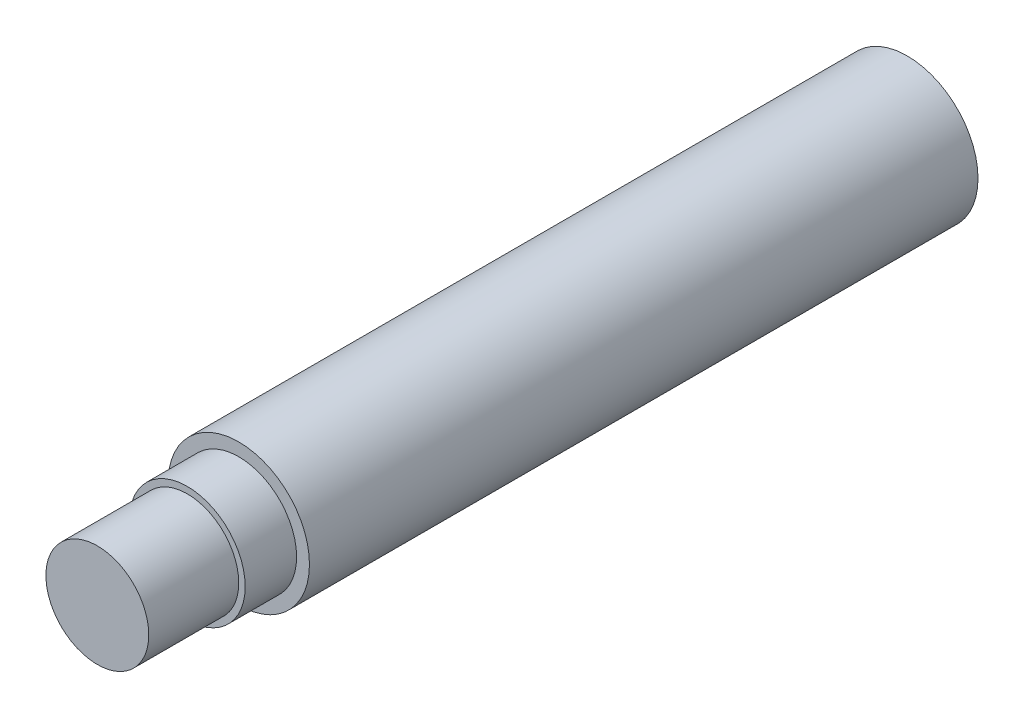
ISO-10303-21;
HEADER;
FILE_DESCRIPTION(('STEP AP214'),'2;1');
FILE_NAME('part.step','',(''),(''),'','','');
FILE_SCHEMA(('AUTOMOTIVE_DESIGN { 1 0 10303 214 1 1 1 1 }'));
ENDSEC;
DATA;
#1=APPLICATION_CONTEXT('core data for automotive mechanical design processes');
#2=APPLICATION_PROTOCOL_DEFINITION('international standard','automotive_design',2000,#1);
#3=PRODUCT_CONTEXT('',#1,'mechanical');
#4=PRODUCT('Part','Part','',(#3));
#5=PRODUCT_RELATED_PRODUCT_CATEGORY('part','',(#4));
#6=PRODUCT_DEFINITION_FORMATION('','',#4);
#7=PRODUCT_DEFINITION_CONTEXT('part definition',#1,'design');
#8=PRODUCT_DEFINITION('design','',#6,#7);
#9=PRODUCT_DEFINITION_SHAPE('','',#8);
#10=(LENGTH_UNIT() NAMED_UNIT(*) SI_UNIT(.MILLI.,.METRE.));
#11=(NAMED_UNIT(*) PLANE_ANGLE_UNIT() SI_UNIT($,.RADIAN.));
#12=(NAMED_UNIT(*) SI_UNIT($,.STERADIAN.) SOLID_ANGLE_UNIT());
#13=UNCERTAINTY_MEASURE_WITH_UNIT(LENGTH_MEASURE(1.E-05),#10,'distance_accuracy_value','');
#14=(GEOMETRIC_REPRESENTATION_CONTEXT(3) GLOBAL_UNCERTAINTY_ASSIGNED_CONTEXT((#13)) GLOBAL_UNIT_ASSIGNED_CONTEXT((#10,
#11,#12)) REPRESENTATION_CONTEXT('',''));
#15=CARTESIAN_POINT('',(0.,0.,0.));
#16=DIRECTION('',(0.,0.,1.));
#17=DIRECTION('',(1.,0.,0.));
#18=AXIS2_PLACEMENT_3D('',#15,#16,#17);
#19=CARTESIAN_POINT('',(0.,0.,56.));
#20=DIRECTION('',(0.,0.,1.));
#21=DIRECTION('',(1.,0.,0.));
#22=AXIS2_PLACEMENT_3D('',#19,#20,#21);
#23=PLANE('',#22);
#24=CARTESIAN_POINT('',(0.,0.,56.));
#25=DIRECTION('',(0.,0.,1.));
#26=DIRECTION('',(1.,0.,0.));
#27=AXIS2_PLACEMENT_3D('',#24,#25,#26);
#28=CIRCLE('',#27,4.5);
#29=CARTESIAN_POINT('',(4.5,0.,56.));
#30=VERTEX_POINT('',#29);
#31=EDGE_CURVE('E72',#30,#30,#28,.T.);
#32=ORIENTED_EDGE('',*,*,#31,.T.);
#33=EDGE_LOOP('',(#32));
#34=FACE_BOUND('',#33,.T.);
#35=CARTESIAN_POINT('',(0.,0.,56.));
#36=DIRECTION('',(0.,0.,1.));
#37=DIRECTION('',(1.,0.,0.));
#38=AXIS2_PLACEMENT_3D('',#35,#36,#37);
#39=CIRCLE('',#38,4.);
#40=CARTESIAN_POINT('',(4.,0.,56.));
#41=VERTEX_POINT('',#40);
#42=EDGE_CURVE('E59',#41,#41,#39,.T.);
#43=ORIENTED_EDGE('',*,*,#42,.F.);
#44=EDGE_LOOP('',(#43));
#45=FACE_BOUND('',#44,.T.);
#46=ADVANCED_FACE('F37',(#34,#45),#23,.T.);
#47=CARTESIAN_POINT('',(0.,0.,52.));
#48=DIRECTION('',(0.,0.,1.));
#49=DIRECTION('',(1.,0.,0.));
#50=AXIS2_PLACEMENT_3D('',#47,#48,#49);
#51=PLANE('',#50);
#52=CARTESIAN_POINT('',(0.,0.,52.));
#53=DIRECTION('',(0.,0.,1.));
#54=DIRECTION('',(1.,0.,0.));
#55=AXIS2_PLACEMENT_3D('',#52,#53,#54);
#56=CIRCLE('',#55,5.5);
#57=CARTESIAN_POINT('',(5.5,0.,52.));
#58=VERTEX_POINT('',#57);
#59=EDGE_CURVE('E11',#58,#58,#56,.T.);
#60=ORIENTED_EDGE('',*,*,#59,.T.);
#61=EDGE_LOOP('',(#60));
#62=FACE_BOUND('',#61,.T.);
#63=CARTESIAN_POINT('',(0.,0.,52.));
#64=DIRECTION('',(0.,0.,1.));
#65=DIRECTION('',(1.,0.,0.));
#66=AXIS2_PLACEMENT_3D('',#63,#64,#65);
#67=CIRCLE('',#66,4.5);
#68=CARTESIAN_POINT('',(4.5,0.,52.));
#69=VERTEX_POINT('',#68);
#70=EDGE_CURVE('E70',#69,#69,#67,.T.);
#71=ORIENTED_EDGE('',*,*,#70,.F.);
#72=EDGE_LOOP('',(#71));
#73=FACE_BOUND('',#72,.T.);
#74=ADVANCED_FACE('F91',(#62,#73),#51,.T.);
#75=CARTESIAN_POINT('',(0.,0.,52.));
#76=DIRECTION('',(0.,0.,-1.));
#77=DIRECTION('',(-1.,0.,0.));
#78=AXIS2_PLACEMENT_3D('',#75,#76,#77);
#79=CYLINDRICAL_SURFACE('',#78,5.5);
#80=ORIENTED_EDGE('',*,*,#59,.F.);
#81=EDGE_LOOP('',(#80));
#82=FACE_BOUND('',#81,.T.);
#83=CARTESIAN_POINT('',(0.,0.,0.));
#84=DIRECTION('',(0.,0.,1.));
#85=DIRECTION('',(1.,0.,0.));
#86=AXIS2_PLACEMENT_3D('',#83,#84,#85);
#87=CIRCLE('',#86,5.5);
#88=CARTESIAN_POINT('',(5.5,0.,0.));
#89=VERTEX_POINT('',#88);
#90=EDGE_CURVE('E45',#89,#89,#87,.T.);
#91=ORIENTED_EDGE('',*,*,#90,.T.);
#92=EDGE_LOOP('',(#91));
#93=FACE_BOUND('',#92,.T.);
#94=ADVANCED_FACE('F39',(#82,#93),#79,.T.);
#95=CARTESIAN_POINT('',(0.,0.,0.));
#96=DIRECTION('',(0.,0.,1.));
#97=DIRECTION('',(1.,0.,0.));
#98=AXIS2_PLACEMENT_3D('',#95,#96,#97);
#99=PLANE('',#98);
#100=CARTESIAN_POINT('',(0.,0.,0.));
#101=DIRECTION('',(0.,0.,-1.));
#102=DIRECTION('',(-1.,0.,0.));
#103=AXIS2_PLACEMENT_3D('',#100,#101,#102);
#104=CIRCLE('',#103,4.025);
#105=CARTESIAN_POINT('',(-4.025,0.,0.));
#106=VERTEX_POINT('',#105);
#107=EDGE_CURVE('E131',#106,#106,#104,.T.);
#108=ORIENTED_EDGE('',*,*,#107,.F.);
#109=EDGE_LOOP('',(#108));
#110=FACE_BOUND('',#109,.T.);
#111=ORIENTED_EDGE('',*,*,#90,.F.);
#112=EDGE_LOOP('',(#111));
#113=FACE_BOUND('',#112,.T.);
#114=ADVANCED_FACE('F80',(#110,#113),#99,.F.);
#115=CARTESIAN_POINT('',(0.,0.,56.));
#116=DIRECTION('',(0.,0.,-1.));
#117=DIRECTION('',(-1.,0.,0.));
#118=AXIS2_PLACEMENT_3D('',#115,#116,#117);
#119=CYLINDRICAL_SURFACE('',#118,4.5);
#120=ORIENTED_EDGE('',*,*,#31,.F.);
#121=EDGE_LOOP('',(#120));
#122=FACE_BOUND('',#121,.T.);
#123=ORIENTED_EDGE('',*,*,#70,.T.);
#124=EDGE_LOOP('',(#123));
#125=FACE_BOUND('',#124,.T.);
#126=ADVANCED_FACE('F82',(#122,#125),#119,.T.);
#127=CARTESIAN_POINT('',(0.,0.,63.));
#128=DIRECTION('',(0.,0.,-1.));
#129=DIRECTION('',(-1.,0.,0.));
#130=AXIS2_PLACEMENT_3D('',#127,#128,#129);
#131=CYLINDRICAL_SURFACE('',#130,4.);
#132=CARTESIAN_POINT('',(0.,0.,63.));
#133=DIRECTION('',(0.,0.,1.));
#134=DIRECTION('',(1.,0.,0.));
#135=AXIS2_PLACEMENT_3D('',#132,#133,#134);
#136=CIRCLE('',#135,4.);
#137=CARTESIAN_POINT('',(4.,0.,63.));
#138=VERTEX_POINT('',#137);
#139=EDGE_CURVE('E62',#138,#138,#136,.T.);
#140=ORIENTED_EDGE('',*,*,#139,.F.);
#141=EDGE_LOOP('',(#140));
#142=FACE_BOUND('',#141,.T.);
#143=ORIENTED_EDGE('',*,*,#42,.T.);
#144=EDGE_LOOP('',(#143));
#145=FACE_BOUND('',#144,.T.);
#146=ADVANCED_FACE('F88',(#142,#145),#131,.T.);
#147=CARTESIAN_POINT('',(0.,0.,63.));
#148=DIRECTION('',(0.,0.,1.));
#149=DIRECTION('',(1.,0.,0.));
#150=AXIS2_PLACEMENT_3D('',#147,#148,#149);
#151=PLANE('',#150);
#152=ORIENTED_EDGE('',*,*,#139,.T.);
#153=EDGE_LOOP('',(#152));
#154=FACE_BOUND('',#153,.T.);
#155=ADVANCED_FACE('F106',(#154),#151,.T.);
#156=CARTESIAN_POINT('',(0.,0.,6.));
#157=DIRECTION('',(0.,0.,-1.));
#158=DIRECTION('',(-1.,0.,0.));
#159=AXIS2_PLACEMENT_3D('',#156,#157,#158);
#160=CONICAL_SURFACE('',#159,3.5,1.02974425867665);
#161=CARTESIAN_POINT('',(0.,0.,6.));
#162=DIRECTION('',(0.,0.,-1.));
#163=DIRECTION('',(-1.,0.,0.));
#164=AXIS2_PLACEMENT_3D('',#161,#162,#163);
#165=CIRCLE('',#164,3.5);
#166=CARTESIAN_POINT('',(-3.5,0.,6.));
#167=VERTEX_POINT('',#166);
#168=EDGE_CURVE('E65',#167,#167,#165,.T.);
#169=ORIENTED_EDGE('',*,*,#168,.T.);
#170=EDGE_LOOP('',(#169));
#171=FACE_BOUND('',#170,.T.);
#172=CARTESIAN_POINT('',(0.,0.,6.60086061902756));
#173=DIRECTION('',(0.,0.,-1.));
#174=DIRECTION('',(-1.,0.,0.));
#175=AXIS2_PLACEMENT_3D('',#172,#173,#174);
#176=CIRCLE('',#175,2.5);
#177=CARTESIAN_POINT('',(-2.5,0.,6.60086061902756));
#178=VERTEX_POINT('',#177);
#179=EDGE_CURVE('E41',#178,#178,#176,.T.);
#180=ORIENTED_EDGE('',*,*,#179,.F.);
#181=EDGE_LOOP('',(#180));
#182=FACE_BOUND('',#181,.T.);
#183=ADVANCED_FACE('F109',(#171,#182),#160,.F.);
#184=CARTESIAN_POINT('',(0.,0.,0.));
#185=DIRECTION('',(0.,0.,-1.));
#186=DIRECTION('',(-1.,0.,0.));
#187=AXIS2_PLACEMENT_3D('',#184,#185,#186);
#188=CYLINDRICAL_SURFACE('',#187,3.5);
#189=ORIENTED_EDGE('',*,*,#168,.F.);
#190=EDGE_LOOP('',(#189));
#191=FACE_BOUND('',#190,.T.);
#192=CARTESIAN_POINT('',(0.,0.,0.525000000000005));
#193=DIRECTION('',(0.,0.,-1.));
#194=DIRECTION('',(-1.,0.,0.));
#195=AXIS2_PLACEMENT_3D('',#192,#193,#194);
#196=CIRCLE('',#195,3.5);
#197=CARTESIAN_POINT('',(-3.5,0.,0.525000000000005));
#198=VERTEX_POINT('',#197);
#199=EDGE_CURVE('E129',#198,#198,#196,.T.);
#200=ORIENTED_EDGE('',*,*,#199,.T.);
#201=EDGE_LOOP('',(#200));
#202=FACE_BOUND('',#201,.T.);
#203=ADVANCED_FACE('F117',(#191,#202),#188,.F.);
#204=CARTESIAN_POINT('',(0.,0.,0.));
#205=DIRECTION('',(0.,0.,-1.));
#206=DIRECTION('',(-1.,0.,0.));
#207=AXIS2_PLACEMENT_3D('',#204,#205,#206);
#208=CONICAL_SURFACE('',#207,4.025,0.785398163397447);
#209=ORIENTED_EDGE('',*,*,#199,.F.);
#210=EDGE_LOOP('',(#209));
#211=FACE_BOUND('',#210,.T.);
#212=ORIENTED_EDGE('',*,*,#107,.T.);
#213=EDGE_LOOP('',(#212));
#214=FACE_BOUND('',#213,.T.);
#215=ADVANCED_FACE('F53',(#211,#214),#208,.F.);
#216=CARTESIAN_POINT('',(0.,0.,45.));
#217=DIRECTION('',(0.,0.,-1.));
#218=DIRECTION('',(-1.,0.,0.));
#219=AXIS2_PLACEMENT_3D('',#216,#217,#218);
#220=CONICAL_SURFACE('',#219,2.49999999999999,1.02974425867665);
#221=CARTESIAN_POINT('',(0.,0.,46.5021515475689));
#222=VERTEX_POINT('',#221);
#223=VERTEX_LOOP('',#222);
#224=FACE_BOUND('',#223,.T.);
#225=CARTESIAN_POINT('',(0.,0.,45.));
#226=DIRECTION('',(0.,0.,-1.));
#227=DIRECTION('',(-1.,0.,0.));
#228=AXIS2_PLACEMENT_3D('',#225,#226,#227);
#229=CIRCLE('',#228,2.49999999999999);
#230=CARTESIAN_POINT('',(-2.49999999999999,0.,45.));
#231=VERTEX_POINT('',#230);
#232=EDGE_CURVE('E57',#231,#231,#229,.T.);
#233=ORIENTED_EDGE('',*,*,#232,.T.);
#234=EDGE_LOOP('',(#233));
#235=FACE_BOUND('',#234,.T.);
#236=ADVANCED_FACE('F49',(#224,#235),#220,.F.);
#237=CARTESIAN_POINT('',(0.,0.,0.));
#238=DIRECTION('',(0.,0.,-1.));
#239=DIRECTION('',(-1.,0.,0.));
#240=AXIS2_PLACEMENT_3D('',#237,#238,#239);
#241=CYLINDRICAL_SURFACE('',#240,2.5);
#242=ORIENTED_EDGE('',*,*,#179,.T.);
#243=EDGE_LOOP('',(#242));
#244=FACE_BOUND('',#243,.T.);
#245=ORIENTED_EDGE('',*,*,#232,.F.);
#246=EDGE_LOOP('',(#245));
#247=FACE_BOUND('',#246,.T.);
#248=ADVANCED_FACE('F52',(#244,#247),#241,.F.);
#249=CLOSED_SHELL('',(#46,#74,#94,#114,#126,#146,#155,#183,#203,#215,#236,#248));
#250=MANIFOLD_SOLID_BREP('B2',#249);
#251=ADVANCED_BREP_SHAPE_REPRESENTATION('',(#18,#250),#14);
#252=SHAPE_DEFINITION_REPRESENTATION(#9,#251);
ENDSEC;
END-ISO-10303-21;
